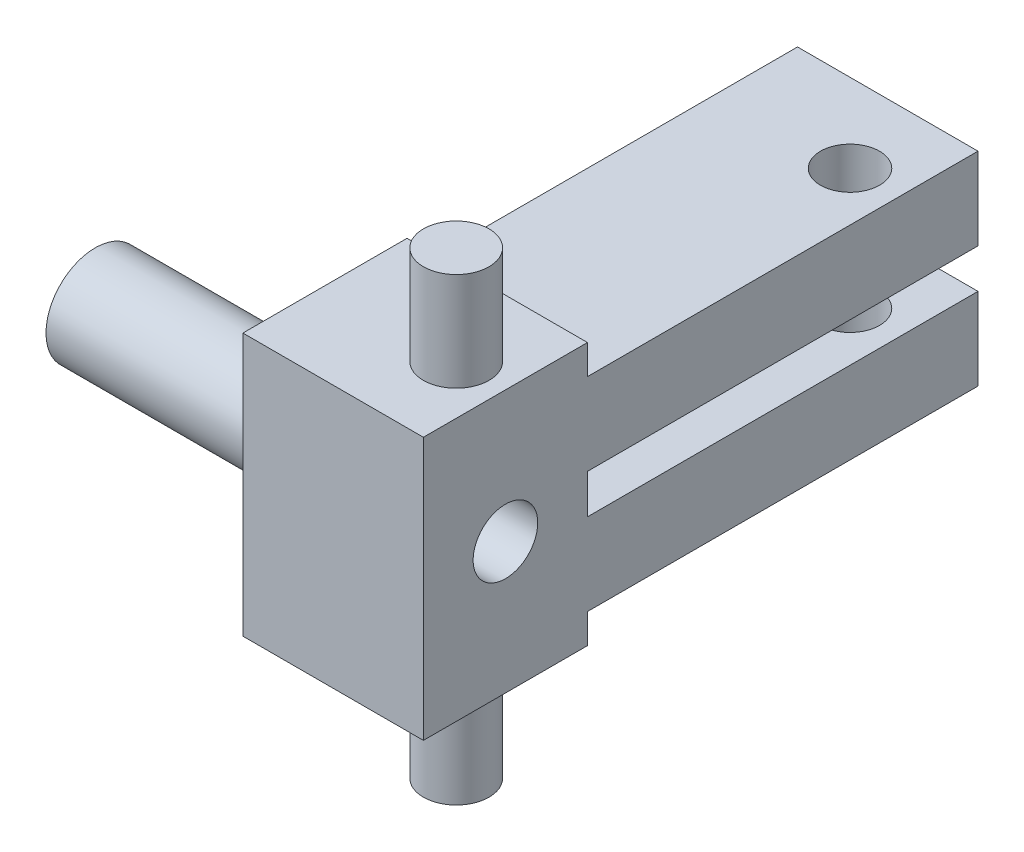
ISO-10303-21;
HEADER;
FILE_DESCRIPTION(('STEP AP214'),'2;1');
FILE_NAME('part.step','',(''),(''),'','','');
FILE_SCHEMA(('AUTOMOTIVE_DESIGN { 1 0 10303 214 1 1 1 1 }'));
ENDSEC;
DATA;
#1=APPLICATION_CONTEXT('core data for automotive mechanical design processes');
#2=APPLICATION_PROTOCOL_DEFINITION('international standard','automotive_design',2000,#1);
#3=PRODUCT_CONTEXT('',#1,'mechanical');
#4=PRODUCT('Part','Part','',(#3));
#5=PRODUCT_RELATED_PRODUCT_CATEGORY('part','',(#4));
#6=PRODUCT_DEFINITION_FORMATION('','',#4);
#7=PRODUCT_DEFINITION_CONTEXT('part definition',#1,'design');
#8=PRODUCT_DEFINITION('design','',#6,#7);
#9=PRODUCT_DEFINITION_SHAPE('','',#8);
#10=(LENGTH_UNIT() NAMED_UNIT(*) SI_UNIT(.MILLI.,.METRE.));
#11=(NAMED_UNIT(*) PLANE_ANGLE_UNIT() SI_UNIT($,.RADIAN.));
#12=(NAMED_UNIT(*) SI_UNIT($,.STERADIAN.) SOLID_ANGLE_UNIT());
#13=UNCERTAINTY_MEASURE_WITH_UNIT(LENGTH_MEASURE(1.E-05),#10,'distance_accuracy_value','');
#14=(GEOMETRIC_REPRESENTATION_CONTEXT(3) GLOBAL_UNCERTAINTY_ASSIGNED_CONTEXT((#13)) GLOBAL_UNIT_ASSIGNED_CONTEXT((#10,
#11,#12)) REPRESENTATION_CONTEXT('',''));
#15=CARTESIAN_POINT('',(0.,0.,0.));
#16=DIRECTION('',(0.,0.,1.));
#17=DIRECTION('',(1.,0.,0.));
#18=AXIS2_PLACEMENT_3D('',#15,#16,#17);
#19=CARTESIAN_POINT('',(67.31,10.16,-6.35));
#20=DIRECTION('',(0.,0.,1.));
#21=DIRECTION('',(1.,0.,0.));
#22=AXIS2_PLACEMENT_3D('',#19,#20,#21);
#23=PLANE('',#22);
#24=DIRECTION('',(0.,1.,0.));
#25=VECTOR('',#24,1.);
#26=CARTESIAN_POINT('',(53.34,10.16,-6.35));
#27=LINE('',#26,#25);
#28=CARTESIAN_POINT('',(53.34,-10.16,-6.35));
#29=VERTEX_POINT('',#28);
#30=CARTESIAN_POINT('',(53.34,-7.874,-6.35));
#31=VERTEX_POINT('',#30);
#32=EDGE_CURVE('E258',#29,#31,#27,.T.);
#33=ORIENTED_EDGE('',*,*,#32,.F.);
#34=DIRECTION('',(-1.,0.,0.));
#35=VECTOR('',#34,1.);
#36=CARTESIAN_POINT('',(67.31,-10.16,-6.35));
#37=LINE('',#36,#35);
#38=CARTESIAN_POINT('',(39.37,-10.16,-6.35));
#39=VERTEX_POINT('',#38);
#40=EDGE_CURVE('E184',#29,#39,#37,.T.);
#41=ORIENTED_EDGE('',*,*,#40,.T.);
#42=DIRECTION('',(0.,-1.,0.));
#43=VECTOR('',#42,1.);
#44=CARTESIAN_POINT('',(39.37,10.16,-6.35));
#45=LINE('',#44,#43);
#46=CARTESIAN_POINT('',(39.37,-7.874,-6.35));
#47=VERTEX_POINT('',#46);
#48=EDGE_CURVE('E223',#47,#39,#45,.T.);
#49=ORIENTED_EDGE('',*,*,#48,.F.);
#50=DIRECTION('',(1.,0.,0.));
#51=VECTOR('',#50,1.);
#52=CARTESIAN_POINT('',(67.31,-7.874,-6.35));
#53=LINE('',#52,#51);
#54=EDGE_CURVE('E170',#47,#31,#53,.T.);
#55=ORIENTED_EDGE('',*,*,#54,.T.);
#56=EDGE_LOOP('',(#33,#41,#49,#55));
#57=FACE_BOUND('',#56,.T.);
#58=ADVANCED_FACE('F44',(#57),#23,.F.);
#59=DIRECTION('',(0.,1.,0.));
#60=VECTOR('',#59,1.);
#61=CARTESIAN_POINT('',(53.34,10.16,-6.35));
#62=LINE('',#61,#60);
#63=CARTESIAN_POINT('',(53.34,-1.524,-6.35));
#64=VERTEX_POINT('',#63);
#65=CARTESIAN_POINT('',(53.34,1.524,-6.35));
#66=VERTEX_POINT('',#65);
#67=EDGE_CURVE('E261',#64,#66,#62,.T.);
#68=ORIENTED_EDGE('',*,*,#67,.F.);
#69=DIRECTION('',(-1.,0.,0.));
#70=VECTOR('',#69,1.);
#71=CARTESIAN_POINT('',(67.31,-1.524,-6.35));
#72=LINE('',#71,#70);
#73=CARTESIAN_POINT('',(39.37,-1.524,-6.35));
#74=VERTEX_POINT('',#73);
#75=EDGE_CURVE('E150',#64,#74,#72,.T.);
#76=ORIENTED_EDGE('',*,*,#75,.T.);
#77=CARTESIAN_POINT('',(39.37,1.524,-6.35));
#78=VERTEX_POINT('',#77);
#79=EDGE_CURVE('E222',#78,#74,#45,.T.);
#80=ORIENTED_EDGE('',*,*,#79,.F.);
#81=DIRECTION('',(1.,0.,0.));
#82=VECTOR('',#81,1.);
#83=CARTESIAN_POINT('',(67.31,1.524,-6.35));
#84=LINE('',#83,#82);
#85=EDGE_CURVE('E12',#78,#66,#84,.T.);
#86=ORIENTED_EDGE('',*,*,#85,.T.);
#87=EDGE_LOOP('',(#68,#76,#80,#86));
#88=FACE_BOUND('',#87,.T.);
#89=ADVANCED_FACE('F339',(#88),#23,.F.);
#90=CARTESIAN_POINT('',(53.34,10.16,6.35));
#91=DIRECTION('',(0.,0.,-1.));
#92=DIRECTION('',(-1.,0.,0.));
#93=AXIS2_PLACEMENT_3D('',#90,#91,#92);
#94=PLANE('',#93);
#95=DIRECTION('',(0.,-1.,0.));
#96=VECTOR('',#95,1.);
#97=CARTESIAN_POINT('',(53.34,10.16,6.35));
#98=LINE('',#97,#96);
#99=CARTESIAN_POINT('',(53.34,10.16,6.35));
#100=VERTEX_POINT('',#99);
#101=CARTESIAN_POINT('',(53.34,-10.16,6.35));
#102=VERTEX_POINT('',#101);
#103=EDGE_CURVE('E248',#100,#102,#98,.T.);
#104=ORIENTED_EDGE('',*,*,#103,.F.);
#105=DIRECTION('',(1.,0.,0.));
#106=VECTOR('',#105,1.);
#107=CARTESIAN_POINT('',(53.34,10.16,6.35));
#108=LINE('',#107,#106);
#109=CARTESIAN_POINT('',(39.37,10.16,6.35));
#110=VERTEX_POINT('',#109);
#111=EDGE_CURVE('E187',#110,#100,#108,.T.);
#112=ORIENTED_EDGE('',*,*,#111,.F.);
#113=DIRECTION('',(0.,-1.,0.));
#114=VECTOR('',#113,1.);
#115=CARTESIAN_POINT('',(39.37,10.16,6.35));
#116=LINE('',#115,#114);
#117=CARTESIAN_POINT('',(39.37,-10.16,6.35));
#118=VERTEX_POINT('',#117);
#119=EDGE_CURVE('E231',#110,#118,#116,.T.);
#120=ORIENTED_EDGE('',*,*,#119,.T.);
#121=DIRECTION('',(1.,0.,0.));
#122=VECTOR('',#121,1.);
#123=CARTESIAN_POINT('',(53.34,-10.16,6.35));
#124=LINE('',#123,#122);
#125=EDGE_CURVE('E178',#118,#102,#124,.T.);
#126=ORIENTED_EDGE('',*,*,#125,.T.);
#127=EDGE_LOOP('',(#104,#112,#120,#126));
#128=FACE_BOUND('',#127,.T.);
#129=ADVANCED_FACE('F46',(#128),#94,.F.);
#130=DIRECTION('',(0.,1.,0.));
#131=VECTOR('',#130,1.);
#132=CARTESIAN_POINT('',(53.34,10.16,-6.35));
#133=LINE('',#132,#131);
#134=CARTESIAN_POINT('',(53.34,7.874,-6.35));
#135=VERTEX_POINT('',#134);
#136=CARTESIAN_POINT('',(53.34,10.16,-6.35));
#137=VERTEX_POINT('',#136);
#138=EDGE_CURVE('E202',#135,#137,#133,.T.);
#139=ORIENTED_EDGE('',*,*,#138,.F.);
#140=DIRECTION('',(-1.,0.,0.));
#141=VECTOR('',#140,1.);
#142=CARTESIAN_POINT('',(67.31,7.874,-6.35));
#143=LINE('',#142,#141);
#144=CARTESIAN_POINT('',(39.37,7.874,-6.35));
#145=VERTEX_POINT('',#144);
#146=EDGE_CURVE('E54',#135,#145,#143,.T.);
#147=ORIENTED_EDGE('',*,*,#146,.T.);
#148=CARTESIAN_POINT('',(39.37,10.16,-6.35));
#149=VERTEX_POINT('',#148);
#150=EDGE_CURVE('E200',#149,#145,#45,.T.);
#151=ORIENTED_EDGE('',*,*,#150,.F.);
#152=DIRECTION('',(-1.,0.,0.));
#153=VECTOR('',#152,1.);
#154=CARTESIAN_POINT('',(67.31,10.16,-6.35));
#155=LINE('',#154,#153);
#156=EDGE_CURVE('E69',#137,#149,#155,.T.);
#157=ORIENTED_EDGE('',*,*,#156,.F.);
#158=EDGE_LOOP('',(#139,#147,#151,#157));
#159=FACE_BOUND('',#158,.T.);
#160=ADVANCED_FACE('F198',(#159),#23,.F.);
#161=CARTESIAN_POINT('',(0.,10.16,0.));
#162=DIRECTION('',(0.,1.,0.));
#163=DIRECTION('',(0.,0.,1.));
#164=AXIS2_PLACEMENT_3D('',#161,#162,#163);
#165=PLANE('',#164);
#166=CARTESIAN_POINT('',(49.53,10.16,0.));
#167=DIRECTION('',(0.,-1.,0.));
#168=DIRECTION('',(0.,0.,1.));
#169=AXIS2_PLACEMENT_3D('',#166,#167,#168);
#170=CIRCLE('',#169,2.54);
#171=CARTESIAN_POINT('',(49.53,10.16,2.54));
#172=VERTEX_POINT('',#171);
#173=EDGE_CURVE('E281',#172,#172,#170,.F.);
#174=ORIENTED_EDGE('',*,*,#173,.F.);
#175=EDGE_LOOP('',(#174));
#176=FACE_BOUND('',#175,.T.);
#177=ORIENTED_EDGE('',*,*,#111,.T.);
#178=DIRECTION('',(0.,0.,-1.));
#179=VECTOR('',#178,1.);
#180=CARTESIAN_POINT('',(53.34,10.16,0.));
#181=LINE('',#180,#179);
#182=EDGE_CURVE('E237',#100,#137,#181,.T.);
#183=ORIENTED_EDGE('',*,*,#182,.T.);
#184=ORIENTED_EDGE('',*,*,#156,.T.);
#185=DIRECTION('',(0.,0.,-1.));
#186=VECTOR('',#185,1.);
#187=CARTESIAN_POINT('',(39.37,10.16,6.35));
#188=LINE('',#187,#186);
#189=EDGE_CURVE('E219',#110,#149,#188,.T.);
#190=ORIENTED_EDGE('',*,*,#189,.F.);
#191=EDGE_LOOP('',(#177,#183,#184,#190));
#192=FACE_BOUND('',#191,.T.);
#193=ADVANCED_FACE('F346',(#176,#192),#165,.T.);
#194=CARTESIAN_POINT('',(0.,-10.16,0.));
#195=DIRECTION('',(0.,1.,0.));
#196=DIRECTION('',(0.,0.,1.));
#197=AXIS2_PLACEMENT_3D('',#194,#195,#196);
#198=PLANE('',#197);
#199=CARTESIAN_POINT('',(49.53,-10.16,0.));
#200=DIRECTION('',(0.,-1.,0.));
#201=DIRECTION('',(0.,0.,1.));
#202=AXIS2_PLACEMENT_3D('',#199,#200,#201);
#203=CIRCLE('',#202,2.54);
#204=CARTESIAN_POINT('',(49.53,-10.16,2.54));
#205=VERTEX_POINT('',#204);
#206=EDGE_CURVE('E287',#205,#205,#203,.F.);
#207=ORIENTED_EDGE('',*,*,#206,.T.);
#208=EDGE_LOOP('',(#207));
#209=FACE_BOUND('',#208,.T.);
#210=DIRECTION('',(0.,0.,-1.));
#211=VECTOR('',#210,1.);
#212=CARTESIAN_POINT('',(53.34,-10.16,0.));
#213=LINE('',#212,#211);
#214=EDGE_CURVE('E251',#102,#29,#213,.T.);
#215=ORIENTED_EDGE('',*,*,#214,.F.);
#216=ORIENTED_EDGE('',*,*,#125,.F.);
#217=DIRECTION('',(0.,0.,-1.));
#218=VECTOR('',#217,1.);
#219=CARTESIAN_POINT('',(39.37,-10.16,6.35));
#220=LINE('',#219,#218);
#221=EDGE_CURVE('E225',#118,#39,#220,.T.);
#222=ORIENTED_EDGE('',*,*,#221,.T.);
#223=ORIENTED_EDGE('',*,*,#40,.F.);
#224=EDGE_LOOP('',(#215,#216,#222,#223));
#225=FACE_BOUND('',#224,.T.);
#226=ADVANCED_FACE('F274',(#209,#225),#198,.F.);
#227=CARTESIAN_POINT('',(98.4444327072134,1.524,-6.35));
#228=DIRECTION('',(0.,-1.,0.));
#229=DIRECTION('',(0.,0.,-1.));
#230=AXIS2_PLACEMENT_3D('',#227,#228,#229);
#231=PLANE('',#230);
#232=CARTESIAN_POINT('',(49.53,1.524,-30.48));
#233=DIRECTION('',(0.,1.,0.));
#234=DIRECTION('',(0.,0.,-1.));
#235=AXIS2_PLACEMENT_3D('',#232,#233,#234);
#236=CIRCLE('',#235,2.286);
#237=CARTESIAN_POINT('',(49.53,1.524,-32.766));
#238=VERTEX_POINT('',#237);
#239=EDGE_CURVE('E307',#238,#238,#236,.T.);
#240=ORIENTED_EDGE('',*,*,#239,.T.);
#241=EDGE_LOOP('',(#240));
#242=FACE_BOUND('',#241,.T.);
#243=DIRECTION('',(-1.,0.,0.));
#244=VECTOR('',#243,1.);
#245=CARTESIAN_POINT('',(98.4444327072134,1.524,-36.576));
#246=LINE('',#245,#244);
#247=CARTESIAN_POINT('',(53.34,1.524,-36.576));
#248=VERTEX_POINT('',#247);
#249=CARTESIAN_POINT('',(39.37,1.524,-36.576));
#250=VERTEX_POINT('',#249);
#251=EDGE_CURVE('E175',#248,#250,#246,.T.);
#252=ORIENTED_EDGE('',*,*,#251,.F.);
#253=DIRECTION('',(0.,0.,1.));
#254=VECTOR('',#253,1.);
#255=CARTESIAN_POINT('',(53.34,1.524,-6.35));
#256=LINE('',#255,#254);
#257=EDGE_CURVE('E254',#248,#66,#256,.T.);
#258=ORIENTED_EDGE('',*,*,#257,.T.);
#259=ORIENTED_EDGE('',*,*,#85,.F.);
#260=DIRECTION('',(0.,0.,-1.));
#261=VECTOR('',#260,1.);
#262=CARTESIAN_POINT('',(39.37,1.524,-6.35));
#263=LINE('',#262,#261);
#264=EDGE_CURVE('E366',#78,#250,#263,.T.);
#265=ORIENTED_EDGE('',*,*,#264,.T.);
#266=EDGE_LOOP('',(#252,#258,#259,#265));
#267=FACE_BOUND('',#266,.T.);
#268=ADVANCED_FACE('F376',(#242,#267),#231,.T.);
#269=CARTESIAN_POINT('',(98.4444327072134,7.874,-6.35));
#270=DIRECTION('',(0.,1.,0.));
#271=DIRECTION('',(0.,0.,1.));
#272=AXIS2_PLACEMENT_3D('',#269,#270,#271);
#273=PLANE('',#272);
#274=CARTESIAN_POINT('',(49.53,7.874,-30.48));
#275=DIRECTION('',(0.,-1.,0.));
#276=DIRECTION('',(0.,0.,1.));
#277=AXIS2_PLACEMENT_3D('',#274,#275,#276);
#278=CIRCLE('',#277,2.286);
#279=CARTESIAN_POINT('',(49.53,7.874,-28.194));
#280=VERTEX_POINT('',#279);
#281=EDGE_CURVE('E311',#280,#280,#278,.T.);
#282=ORIENTED_EDGE('',*,*,#281,.T.);
#283=EDGE_LOOP('',(#282));
#284=FACE_BOUND('',#283,.T.);
#285=ORIENTED_EDGE('',*,*,#146,.F.);
#286=DIRECTION('',(0.,0.,-1.));
#287=VECTOR('',#286,1.);
#288=CARTESIAN_POINT('',(53.34,7.874,-6.35));
#289=LINE('',#288,#287);
#290=CARTESIAN_POINT('',(53.34,7.874,-36.576));
#291=VERTEX_POINT('',#290);
#292=EDGE_CURVE('E239',#135,#291,#289,.T.);
#293=ORIENTED_EDGE('',*,*,#292,.T.);
#294=DIRECTION('',(-1.,0.,0.));
#295=VECTOR('',#294,1.);
#296=CARTESIAN_POINT('',(98.4444327072134,7.874,-36.576));
#297=LINE('',#296,#295);
#298=CARTESIAN_POINT('',(39.37,7.874,-36.576));
#299=VERTEX_POINT('',#298);
#300=EDGE_CURVE('E174',#291,#299,#297,.T.);
#301=ORIENTED_EDGE('',*,*,#300,.T.);
#302=DIRECTION('',(0.,0.,1.));
#303=VECTOR('',#302,1.);
#304=CARTESIAN_POINT('',(39.37,7.874,-6.35));
#305=LINE('',#304,#303);
#306=EDGE_CURVE('E206',#299,#145,#305,.T.);
#307=ORIENTED_EDGE('',*,*,#306,.T.);
#308=EDGE_LOOP('',(#285,#293,#301,#307));
#309=FACE_BOUND('',#308,.T.);
#310=ADVANCED_FACE('F207',(#284,#309),#273,.T.);
#311=CARTESIAN_POINT('',(98.4444327072134,10.16,-36.576));
#312=DIRECTION('',(0.,0.,-1.));
#313=DIRECTION('',(-1.,0.,0.));
#314=AXIS2_PLACEMENT_3D('',#311,#312,#313);
#315=PLANE('',#314);
#316=ORIENTED_EDGE('',*,*,#300,.F.);
#317=DIRECTION('',(0.,-1.,0.));
#318=VECTOR('',#317,1.);
#319=CARTESIAN_POINT('',(53.34,10.16,-36.576));
#320=LINE('',#319,#318);
#321=EDGE_CURVE('E244',#291,#248,#320,.T.);
#322=ORIENTED_EDGE('',*,*,#321,.T.);
#323=ORIENTED_EDGE('',*,*,#251,.T.);
#324=DIRECTION('',(0.,1.,0.));
#325=VECTOR('',#324,1.);
#326=CARTESIAN_POINT('',(39.37,10.16,-36.576));
#327=LINE('',#326,#325);
#328=EDGE_CURVE('E213',#250,#299,#327,.T.);
#329=ORIENTED_EDGE('',*,*,#328,.T.);
#330=EDGE_LOOP('',(#316,#322,#323,#329));
#331=FACE_BOUND('',#330,.T.);
#332=ADVANCED_FACE('F336',(#331),#315,.T.);
#333=CARTESIAN_POINT('',(98.4444327072134,-7.874,-6.35));
#334=DIRECTION('',(0.,-1.,0.));
#335=DIRECTION('',(0.,0.,-1.));
#336=AXIS2_PLACEMENT_3D('',#333,#334,#335);
#337=PLANE('',#336);
#338=CARTESIAN_POINT('',(49.53,-7.874,-30.48));
#339=DIRECTION('',(0.,1.,0.));
#340=DIRECTION('',(0.,0.,-1.));
#341=AXIS2_PLACEMENT_3D('',#338,#339,#340);
#342=CIRCLE('',#341,2.286);
#343=CARTESIAN_POINT('',(49.53,-7.874,-32.766));
#344=VERTEX_POINT('',#343);
#345=EDGE_CURVE('E165',#344,#344,#342,.T.);
#346=ORIENTED_EDGE('',*,*,#345,.T.);
#347=EDGE_LOOP('',(#346));
#348=FACE_BOUND('',#347,.T.);
#349=DIRECTION('',(-1.,0.,0.));
#350=VECTOR('',#349,1.);
#351=CARTESIAN_POINT('',(98.4444327072134,-7.874,-36.576));
#352=LINE('',#351,#350);
#353=CARTESIAN_POINT('',(53.34,-7.874,-36.576));
#354=VERTEX_POINT('',#353);
#355=CARTESIAN_POINT('',(39.37,-7.874,-36.576));
#356=VERTEX_POINT('',#355);
#357=EDGE_CURVE('E158',#354,#356,#352,.T.);
#358=ORIENTED_EDGE('',*,*,#357,.F.);
#359=DIRECTION('',(0.,0.,1.));
#360=VECTOR('',#359,1.);
#361=CARTESIAN_POINT('',(53.34,-7.874,-6.35));
#362=LINE('',#361,#360);
#363=EDGE_CURVE('E61',#354,#31,#362,.T.);
#364=ORIENTED_EDGE('',*,*,#363,.T.);
#365=ORIENTED_EDGE('',*,*,#54,.F.);
#366=DIRECTION('',(0.,0.,-1.));
#367=VECTOR('',#366,1.);
#368=CARTESIAN_POINT('',(39.37,-7.874,-6.35));
#369=LINE('',#368,#367);
#370=EDGE_CURVE('E357',#47,#356,#369,.T.);
#371=ORIENTED_EDGE('',*,*,#370,.T.);
#372=EDGE_LOOP('',(#358,#364,#365,#371));
#373=FACE_BOUND('',#372,.T.);
#374=ADVANCED_FACE('F266',(#348,#373),#337,.T.);
#375=CARTESIAN_POINT('',(98.4444327072134,-1.524,-6.35));
#376=DIRECTION('',(0.,1.,0.));
#377=DIRECTION('',(0.,0.,1.));
#378=AXIS2_PLACEMENT_3D('',#375,#376,#377);
#379=PLANE('',#378);
#380=CARTESIAN_POINT('',(49.53,-1.524,-30.48));
#381=DIRECTION('',(0.,-1.,0.));
#382=DIRECTION('',(0.,0.,1.));
#383=AXIS2_PLACEMENT_3D('',#380,#381,#382);
#384=CIRCLE('',#383,2.286);
#385=CARTESIAN_POINT('',(49.53,-1.524,-28.194));
#386=VERTEX_POINT('',#385);
#387=EDGE_CURVE('E159',#386,#386,#384,.T.);
#388=ORIENTED_EDGE('',*,*,#387,.T.);
#389=EDGE_LOOP('',(#388));
#390=FACE_BOUND('',#389,.T.);
#391=ORIENTED_EDGE('',*,*,#75,.F.);
#392=DIRECTION('',(0.,0.,-1.));
#393=VECTOR('',#392,1.);
#394=CARTESIAN_POINT('',(53.34,-1.524,-6.35));
#395=LINE('',#394,#393);
#396=CARTESIAN_POINT('',(53.34,-1.524,-36.576));
#397=VERTEX_POINT('',#396);
#398=EDGE_CURVE('E137',#64,#397,#395,.T.);
#399=ORIENTED_EDGE('',*,*,#398,.T.);
#400=DIRECTION('',(-1.,0.,0.));
#401=VECTOR('',#400,1.);
#402=CARTESIAN_POINT('',(98.4444327072134,-1.524,-36.576));
#403=LINE('',#402,#401);
#404=CARTESIAN_POINT('',(39.37,-1.524,-36.576));
#405=VERTEX_POINT('',#404);
#406=EDGE_CURVE('E148',#397,#405,#403,.T.);
#407=ORIENTED_EDGE('',*,*,#406,.T.);
#408=DIRECTION('',(0.,0.,1.));
#409=VECTOR('',#408,1.);
#410=CARTESIAN_POINT('',(39.37,-1.524,-6.35));
#411=LINE('',#410,#409);
#412=EDGE_CURVE('E363',#405,#74,#411,.T.);
#413=ORIENTED_EDGE('',*,*,#412,.T.);
#414=EDGE_LOOP('',(#391,#399,#407,#413));
#415=FACE_BOUND('',#414,.T.);
#416=ADVANCED_FACE('F146',(#390,#415),#379,.T.);
#417=CARTESIAN_POINT('',(98.4444327072134,10.16,-36.576));
#418=DIRECTION('',(0.,0.,-1.));
#419=DIRECTION('',(0.,1.,0.));
#420=AXIS2_PLACEMENT_3D('',#417,#418,#419);
#421=PLANE('',#420);
#422=ORIENTED_EDGE('',*,*,#406,.F.);
#423=DIRECTION('',(0.,-1.,0.));
#424=VECTOR('',#423,1.);
#425=CARTESIAN_POINT('',(53.34,10.16,-36.576));
#426=LINE('',#425,#424);
#427=EDGE_CURVE('E134',#397,#354,#426,.T.);
#428=ORIENTED_EDGE('',*,*,#427,.T.);
#429=ORIENTED_EDGE('',*,*,#357,.T.);
#430=DIRECTION('',(0.,1.,0.));
#431=VECTOR('',#430,1.);
#432=CARTESIAN_POINT('',(39.37,10.16,-36.576));
#433=LINE('',#432,#431);
#434=EDGE_CURVE('E155',#356,#405,#433,.T.);
#435=ORIENTED_EDGE('',*,*,#434,.T.);
#436=EDGE_LOOP('',(#422,#428,#429,#435));
#437=FACE_BOUND('',#436,.T.);
#438=ADVANCED_FACE('F153',(#437),#421,.T.);
#439=CARTESIAN_POINT('',(53.34,0.,0.));
#440=DIRECTION('',(-1.,0.,0.));
#441=DIRECTION('',(0.,0.,1.));
#442=AXIS2_PLACEMENT_3D('',#439,#440,#441);
#443=CYLINDRICAL_SURFACE('',#442,2.5);
#444=CARTESIAN_POINT('',(21.59,0.,0.));
#445=DIRECTION('',(1.,0.,0.));
#446=DIRECTION('',(0.,0.,-1.));
#447=AXIS2_PLACEMENT_3D('',#444,#445,#446);
#448=CIRCLE('',#447,2.5);
#449=CARTESIAN_POINT('',(21.59,0.,-2.5));
#450=VERTEX_POINT('',#449);
#451=EDGE_CURVE('E303',#450,#450,#448,.T.);
#452=ORIENTED_EDGE('',*,*,#451,.F.);
#453=EDGE_LOOP('',(#452));
#454=FACE_BOUND('',#453,.T.);
#455=CARTESIAN_POINT('',(53.34,0.,0.));
#456=DIRECTION('',(1.,0.,0.));
#457=DIRECTION('',(0.,0.,-1.));
#458=AXIS2_PLACEMENT_3D('',#455,#456,#457);
#459=CIRCLE('',#458,2.5);
#460=CARTESIAN_POINT('',(53.34,0.,-2.5));
#461=VERTEX_POINT('',#460);
#462=EDGE_CURVE('E48',#461,#461,#459,.T.);
#463=ORIENTED_EDGE('',*,*,#462,.T.);
#464=EDGE_LOOP('',(#463));
#465=FACE_BOUND('',#464,.T.);
#466=ADVANCED_FACE('F334',(#454,#465),#443,.F.);
#467=CARTESIAN_POINT('',(39.37,10.16,6.35));
#468=DIRECTION('',(1.,0.,0.));
#469=DIRECTION('',(0.,0.,1.));
#470=AXIS2_PLACEMENT_3D('',#467,#468,#469);
#471=PLANE('',#470);
#472=ORIENTED_EDGE('',*,*,#48,.T.);
#473=ORIENTED_EDGE('',*,*,#221,.F.);
#474=ORIENTED_EDGE('',*,*,#119,.F.);
#475=ORIENTED_EDGE('',*,*,#189,.T.);
#476=ORIENTED_EDGE('',*,*,#150,.T.);
#477=ORIENTED_EDGE('',*,*,#306,.F.);
#478=ORIENTED_EDGE('',*,*,#328,.F.);
#479=ORIENTED_EDGE('',*,*,#264,.F.);
#480=ORIENTED_EDGE('',*,*,#79,.T.);
#481=ORIENTED_EDGE('',*,*,#412,.F.);
#482=ORIENTED_EDGE('',*,*,#434,.F.);
#483=ORIENTED_EDGE('',*,*,#370,.F.);
#484=EDGE_LOOP('',(#472,#473,#474,#475,#476,#477,#478,#479,#480,#481,#482,#483));
#485=FACE_BOUND('',#484,.T.);
#486=CARTESIAN_POINT('',(39.37,0.,0.));
#487=DIRECTION('',(-1.,0.,0.));
#488=DIRECTION('',(0.,0.,1.));
#489=AXIS2_PLACEMENT_3D('',#486,#487,#488);
#490=CIRCLE('',#489,3.81);
#491=CARTESIAN_POINT('',(39.37,0.,3.81));
#492=VERTEX_POINT('',#491);
#493=EDGE_CURVE('E277',#492,#492,#490,.F.);
#494=ORIENTED_EDGE('',*,*,#493,.T.);
#495=EDGE_LOOP('',(#494));
#496=FACE_BOUND('',#495,.T.);
#497=ADVANCED_FACE('F216',(#485,#496),#471,.F.);
#498=CARTESIAN_POINT('',(106.68,-17.78,0.));
#499=DIRECTION('',(0.,1.,0.));
#500=DIRECTION('',(0.,0.,1.));
#501=AXIS2_PLACEMENT_3D('',#498,#499,#500);
#502=PLANE('',#501);
#503=CARTESIAN_POINT('',(49.53,-17.78,0.));
#504=DIRECTION('',(0.,-1.,0.));
#505=DIRECTION('',(0.,0.,1.));
#506=AXIS2_PLACEMENT_3D('',#503,#504,#505);
#507=CIRCLE('',#506,2.54);
#508=CARTESIAN_POINT('',(49.53,-17.78,2.54));
#509=VERTEX_POINT('',#508);
#510=EDGE_CURVE('E291',#509,#509,#507,.F.);
#511=ORIENTED_EDGE('',*,*,#510,.F.);
#512=EDGE_LOOP('',(#511));
#513=FACE_BOUND('',#512,.T.);
#514=ADVANCED_FACE('F478',(#513),#502,.F.);
#515=CARTESIAN_POINT('',(49.53,32.5842048968553,0.));
#516=DIRECTION('',(0.,-1.,0.));
#517=DIRECTION('',(0.,0.,-1.));
#518=AXIS2_PLACEMENT_3D('',#515,#516,#517);
#519=CYLINDRICAL_SURFACE('',#518,2.54);
#520=ORIENTED_EDGE('',*,*,#510,.T.);
#521=EDGE_LOOP('',(#520));
#522=FACE_BOUND('',#521,.T.);
#523=ORIENTED_EDGE('',*,*,#206,.F.);
#524=EDGE_LOOP('',(#523));
#525=FACE_BOUND('',#524,.T.);
#526=ADVANCED_FACE('F470',(#522,#525),#519,.T.);
#527=ORIENTED_EDGE('',*,*,#173,.T.);
#528=EDGE_LOOP('',(#527));
#529=FACE_BOUND('',#528,.T.);
#530=CARTESIAN_POINT('',(49.53,17.78,0.));
#531=DIRECTION('',(0.,-1.,0.));
#532=DIRECTION('',(0.,0.,1.));
#533=AXIS2_PLACEMENT_3D('',#530,#531,#532);
#534=CIRCLE('',#533,2.54);
#535=CARTESIAN_POINT('',(49.53,17.78,2.54));
#536=VERTEX_POINT('',#535);
#537=EDGE_CURVE('E295',#536,#536,#534,.T.);
#538=ORIENTED_EDGE('',*,*,#537,.T.);
#539=EDGE_LOOP('',(#538));
#540=FACE_BOUND('',#539,.T.);
#541=ADVANCED_FACE('F462',(#529,#540),#519,.T.);
#542=CARTESIAN_POINT('',(106.68,17.78,0.));
#543=DIRECTION('',(0.,1.,0.));
#544=DIRECTION('',(0.,0.,1.));
#545=AXIS2_PLACEMENT_3D('',#542,#543,#544);
#546=PLANE('',#545);
#547=ORIENTED_EDGE('',*,*,#537,.F.);
#548=EDGE_LOOP('',(#547));
#549=FACE_BOUND('',#548,.T.);
#550=ADVANCED_FACE('F454',(#549),#546,.T.);
#551=CARTESIAN_POINT('',(-6.96630734528295,0.,0.));
#552=DIRECTION('',(1.,0.,0.));
#553=DIRECTION('',(0.,0.,1.));
#554=AXIS2_PLACEMENT_3D('',#551,#552,#553);
#555=CYLINDRICAL_SURFACE('',#554,3.81);
#556=CARTESIAN_POINT('',(21.59,0.,0.));
#557=DIRECTION('',(-1.,0.,0.));
#558=DIRECTION('',(0.,0.,1.));
#559=AXIS2_PLACEMENT_3D('',#556,#557,#558);
#560=CIRCLE('',#559,3.81);
#561=CARTESIAN_POINT('',(21.59,0.,3.81));
#562=VERTEX_POINT('',#561);
#563=EDGE_CURVE('E299',#562,#562,#560,.T.);
#564=ORIENTED_EDGE('',*,*,#563,.F.);
#565=EDGE_LOOP('',(#564));
#566=FACE_BOUND('',#565,.T.);
#567=ORIENTED_EDGE('',*,*,#493,.F.);
#568=EDGE_LOOP('',(#567));
#569=FACE_BOUND('',#568,.T.);
#570=ADVANCED_FACE('F446',(#566,#569),#555,.T.);
#571=CARTESIAN_POINT('',(21.59,10.16,6.35));
#572=DIRECTION('',(1.,0.,0.));
#573=DIRECTION('',(0.,0.,1.));
#574=AXIS2_PLACEMENT_3D('',#571,#572,#573);
#575=PLANE('',#574);
#576=ORIENTED_EDGE('',*,*,#451,.T.);
#577=EDGE_LOOP('',(#576));
#578=FACE_BOUND('',#577,.T.);
#579=ORIENTED_EDGE('',*,*,#563,.T.);
#580=EDGE_LOOP('',(#579));
#581=FACE_BOUND('',#580,.T.);
#582=ADVANCED_FACE('F324',(#578,#581),#575,.F.);
#583=CARTESIAN_POINT('',(49.53,-17.78,-30.48));
#584=DIRECTION('',(0.,1.,0.));
#585=DIRECTION('',(0.,0.,1.));
#586=AXIS2_PLACEMENT_3D('',#583,#584,#585);
#587=CYLINDRICAL_SURFACE('',#586,2.286);
#588=ORIENTED_EDGE('',*,*,#345,.F.);
#589=EDGE_LOOP('',(#588));
#590=FACE_BOUND('',#589,.T.);
#591=ORIENTED_EDGE('',*,*,#387,.F.);
#592=EDGE_LOOP('',(#591));
#593=FACE_BOUND('',#592,.T.);
#594=ADVANCED_FACE('F320',(#590,#593),#587,.F.);
#595=ORIENTED_EDGE('',*,*,#239,.F.);
#596=EDGE_LOOP('',(#595));
#597=FACE_BOUND('',#596,.T.);
#598=ORIENTED_EDGE('',*,*,#281,.F.);
#599=EDGE_LOOP('',(#598));
#600=FACE_BOUND('',#599,.T.);
#601=ADVANCED_FACE('F323',(#597,#600),#587,.F.);
#602=CARTESIAN_POINT('',(53.34,0.,0.));
#603=DIRECTION('',(1.,0.,0.));
#604=DIRECTION('',(0.,0.,-1.));
#605=AXIS2_PLACEMENT_3D('',#602,#603,#604);
#606=PLANE('',#605);
#607=ORIENTED_EDGE('',*,*,#462,.F.);
#608=EDGE_LOOP('',(#607));
#609=FACE_BOUND('',#608,.T.);
#610=ORIENTED_EDGE('',*,*,#138,.T.);
#611=ORIENTED_EDGE('',*,*,#182,.F.);
#612=ORIENTED_EDGE('',*,*,#103,.T.);
#613=ORIENTED_EDGE('',*,*,#214,.T.);
#614=ORIENTED_EDGE('',*,*,#32,.T.);
#615=ORIENTED_EDGE('',*,*,#363,.F.);
#616=ORIENTED_EDGE('',*,*,#427,.F.);
#617=ORIENTED_EDGE('',*,*,#398,.F.);
#618=ORIENTED_EDGE('',*,*,#67,.T.);
#619=ORIENTED_EDGE('',*,*,#257,.F.);
#620=ORIENTED_EDGE('',*,*,#321,.F.);
#621=ORIENTED_EDGE('',*,*,#292,.F.);
#622=EDGE_LOOP('',(#610,#611,#612,#613,#614,#615,#616,#617,#618,#619,#620,#621));
#623=FACE_BOUND('',#622,.T.);
#624=ADVANCED_FACE('F136',(#609,#623),#606,.T.);
#625=CLOSED_SHELL('',(#58,#89,#129,#160,#193,#226,#268,#310,#332,#374,#416,#438,#466,#497,#514,
#526,#541,#550,#570,#582,#594,#601,#624));
#626=MANIFOLD_SOLID_BREP('B2',#625);
#627=ADVANCED_BREP_SHAPE_REPRESENTATION('',(#18,#626),#14);
#628=SHAPE_DEFINITION_REPRESENTATION(#9,#627);
ENDSEC;
END-ISO-10303-21;
